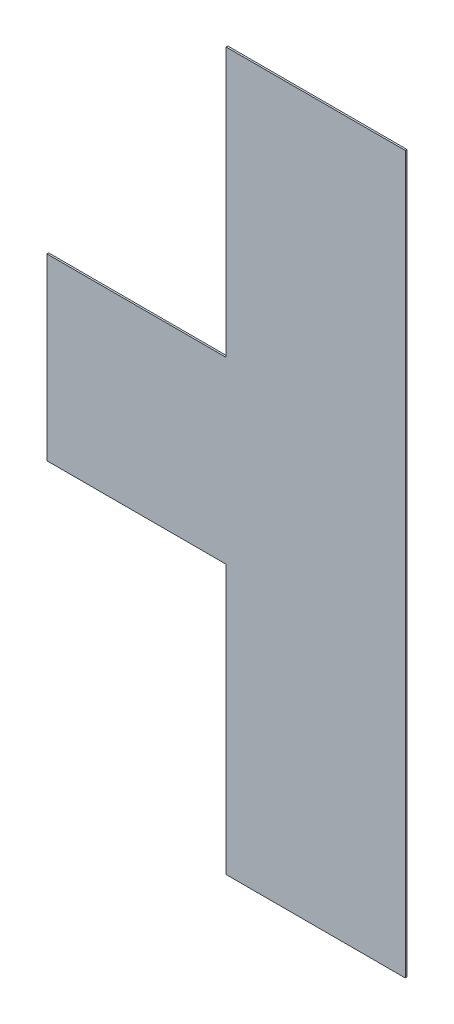
ISO-10303-21;
HEADER;
FILE_DESCRIPTION(('STEP AP214'),'2;1');
FILE_NAME('part.step','',(''),(''),'','','');
FILE_SCHEMA(('AUTOMOTIVE_DESIGN { 1 0 10303 214 1 1 1 1 }'));
ENDSEC;
DATA;
#1=APPLICATION_CONTEXT('core data for automotive mechanical design processes');
#2=APPLICATION_PROTOCOL_DEFINITION('international standard','automotive_design',2000,#1);
#3=PRODUCT_CONTEXT('',#1,'mechanical');
#4=PRODUCT('Part','Part','',(#3));
#5=PRODUCT_RELATED_PRODUCT_CATEGORY('part','',(#4));
#6=PRODUCT_DEFINITION_FORMATION('','',#4);
#7=PRODUCT_DEFINITION_CONTEXT('part definition',#1,'design');
#8=PRODUCT_DEFINITION('design','',#6,#7);
#9=PRODUCT_DEFINITION_SHAPE('','',#8);
#10=(LENGTH_UNIT() NAMED_UNIT(*) SI_UNIT(.MILLI.,.METRE.));
#11=(NAMED_UNIT(*) PLANE_ANGLE_UNIT() SI_UNIT($,.RADIAN.));
#12=(NAMED_UNIT(*) SI_UNIT($,.STERADIAN.) SOLID_ANGLE_UNIT());
#13=UNCERTAINTY_MEASURE_WITH_UNIT(LENGTH_MEASURE(1.E-05),#10,'distance_accuracy_value','');
#14=(GEOMETRIC_REPRESENTATION_CONTEXT(3) GLOBAL_UNCERTAINTY_ASSIGNED_CONTEXT((#13)) GLOBAL_UNIT_ASSIGNED_CONTEXT((#10,
#11,#12)) REPRESENTATION_CONTEXT('',''));
#15=CARTESIAN_POINT('',(0.,0.,0.));
#16=DIRECTION('',(0.,0.,1.));
#17=DIRECTION('',(1.,0.,0.));
#18=AXIS2_PLACEMENT_3D('',#15,#16,#17);
#19=CARTESIAN_POINT('',(0.2,0.4,0.002));
#20=DIRECTION('',(0.,0.,1.));
#21=DIRECTION('',(0.,-1.,0.));
#22=AXIS2_PLACEMENT_3D('',#19,#20,#21);
#23=PLANE('',#22);
#24=DIRECTION('',(-1.,0.,0.));
#25=VECTOR('',#24,1.);
#26=CARTESIAN_POINT('',(0.2,-0.4,0.002));
#27=LINE('',#26,#25);
#28=CARTESIAN_POINT('',(0.2,-0.4,0.002));
#29=VERTEX_POINT('',#28);
#30=CARTESIAN_POINT('',(0.,-0.4,0.002));
#31=VERTEX_POINT('',#30);
#32=EDGE_CURVE('E160',#29,#31,#27,.T.);
#33=ORIENTED_EDGE('',*,*,#32,.F.);
#34=DIRECTION('',(0.,-1.,0.));
#35=VECTOR('',#34,1.);
#36=CARTESIAN_POINT('',(0.2,0.4,0.002));
#37=LINE('',#36,#35);
#38=CARTESIAN_POINT('',(0.2,0.4,0.002));
#39=VERTEX_POINT('',#38);
#40=EDGE_CURVE('E164',#39,#29,#37,.T.);
#41=ORIENTED_EDGE('',*,*,#40,.F.);
#42=DIRECTION('',(-1.,0.,0.));
#43=VECTOR('',#42,1.);
#44=CARTESIAN_POINT('',(0.2,0.4,0.002));
#45=LINE('',#44,#43);
#46=CARTESIAN_POINT('',(0.,0.4,0.002));
#47=VERTEX_POINT('',#46);
#48=EDGE_CURVE('E11',#39,#47,#45,.T.);
#49=ORIENTED_EDGE('',*,*,#48,.T.);
#50=DIRECTION('',(0.,-1.,0.));
#51=VECTOR('',#50,1.);
#52=CARTESIAN_POINT('',(0.,0.4,0.002));
#53=LINE('',#52,#51);
#54=CARTESIAN_POINT('',(0.,0.1,0.002));
#55=VERTEX_POINT('',#54);
#56=EDGE_CURVE('E76',#47,#55,#53,.T.);
#57=ORIENTED_EDGE('',*,*,#56,.T.);
#58=DIRECTION('',(-1.,0.,0.));
#59=VECTOR('',#58,1.);
#60=CARTESIAN_POINT('',(0.,0.1,0.002));
#61=LINE('',#60,#59);
#62=CARTESIAN_POINT('',(-0.2,0.1,0.002));
#63=VERTEX_POINT('',#62);
#64=EDGE_CURVE('E74',#55,#63,#61,.T.);
#65=ORIENTED_EDGE('',*,*,#64,.T.);
#66=DIRECTION('',(0.,1.,0.));
#67=VECTOR('',#66,1.);
#68=CARTESIAN_POINT('',(-0.2,-0.1,0.002));
#69=LINE('',#68,#67);
#70=CARTESIAN_POINT('',(-0.2,-0.1,0.002));
#71=VERTEX_POINT('',#70);
#72=EDGE_CURVE('E68',#71,#63,#69,.T.);
#73=ORIENTED_EDGE('',*,*,#72,.F.);
#74=DIRECTION('',(-1.,0.,0.));
#75=VECTOR('',#74,1.);
#76=CARTESIAN_POINT('',(0.,-0.1,0.002));
#77=LINE('',#76,#75);
#78=CARTESIAN_POINT('',(0.,-0.1,0.002));
#79=VERTEX_POINT('',#78);
#80=EDGE_CURVE('E101',#79,#71,#77,.T.);
#81=ORIENTED_EDGE('',*,*,#80,.F.);
#82=DIRECTION('',(0.,1.,0.));
#83=VECTOR('',#82,1.);
#84=CARTESIAN_POINT('',(0.,-0.4,0.002));
#85=LINE('',#84,#83);
#86=EDGE_CURVE('E186',#31,#79,#85,.T.);
#87=ORIENTED_EDGE('',*,*,#86,.F.);
#88=EDGE_LOOP('',(#33,#41,#49,#57,#65,#73,#81,#87));
#89=FACE_BOUND('',#88,.T.);
#90=ADVANCED_FACE('F17',(#89),#23,.T.);
#91=CARTESIAN_POINT('',(0.2,0.4,0.));
#92=DIRECTION('',(0.,-1.,0.));
#93=DIRECTION('',(-1.,0.,0.));
#94=AXIS2_PLACEMENT_3D('',#91,#92,#93);
#95=PLANE('',#94);
#96=DIRECTION('',(0.,0.,1.));
#97=VECTOR('',#96,1.);
#98=CARTESIAN_POINT('',(0.,0.4,0.));
#99=LINE('',#98,#97);
#100=CARTESIAN_POINT('',(0.,0.4,0.));
#101=VERTEX_POINT('',#100);
#102=EDGE_CURVE('E27',#101,#47,#99,.T.);
#103=ORIENTED_EDGE('',*,*,#102,.T.);
#104=ORIENTED_EDGE('',*,*,#48,.F.);
#105=DIRECTION('',(0.,0.,1.));
#106=VECTOR('',#105,1.);
#107=CARTESIAN_POINT('',(0.2,0.4,0.));
#108=LINE('',#107,#106);
#109=CARTESIAN_POINT('',(0.2,0.4,0.));
#110=VERTEX_POINT('',#109);
#111=EDGE_CURVE('E200',#110,#39,#108,.T.);
#112=ORIENTED_EDGE('',*,*,#111,.F.);
#113=DIRECTION('',(-1.,0.,0.));
#114=VECTOR('',#113,1.);
#115=CARTESIAN_POINT('',(0.2,0.4,0.));
#116=LINE('',#115,#114);
#117=EDGE_CURVE('E120',#110,#101,#116,.T.);
#118=ORIENTED_EDGE('',*,*,#117,.T.);
#119=EDGE_LOOP('',(#103,#104,#112,#118));
#120=FACE_BOUND('',#119,.T.);
#121=ADVANCED_FACE('F118',(#120),#95,.F.);
#122=CARTESIAN_POINT('',(0.,0.4,0.));
#123=DIRECTION('',(1.,0.,0.));
#124=DIRECTION('',(0.,1.,0.));
#125=AXIS2_PLACEMENT_3D('',#122,#123,#124);
#126=PLANE('',#125);
#127=DIRECTION('',(0.,0.,1.));
#128=VECTOR('',#127,1.);
#129=CARTESIAN_POINT('',(0.,0.1,0.));
#130=LINE('',#129,#128);
#131=CARTESIAN_POINT('',(0.,0.1,0.));
#132=VERTEX_POINT('',#131);
#133=EDGE_CURVE('E82',#132,#55,#130,.T.);
#134=ORIENTED_EDGE('',*,*,#133,.T.);
#135=ORIENTED_EDGE('',*,*,#56,.F.);
#136=ORIENTED_EDGE('',*,*,#102,.F.);
#137=DIRECTION('',(0.,-1.,0.));
#138=VECTOR('',#137,1.);
#139=CARTESIAN_POINT('',(0.,0.4,0.));
#140=LINE('',#139,#138);
#141=EDGE_CURVE('E124',#101,#132,#140,.T.);
#142=ORIENTED_EDGE('',*,*,#141,.T.);
#143=EDGE_LOOP('',(#134,#135,#136,#142));
#144=FACE_BOUND('',#143,.T.);
#145=ADVANCED_FACE('F19',(#144),#126,.F.);
#146=CARTESIAN_POINT('',(0.,0.1,0.));
#147=DIRECTION('',(0.,-1.,0.));
#148=DIRECTION('',(-1.,0.,0.));
#149=AXIS2_PLACEMENT_3D('',#146,#147,#148);
#150=PLANE('',#149);
#151=DIRECTION('',(0.,0.,-1.));
#152=VECTOR('',#151,1.);
#153=CARTESIAN_POINT('',(-0.2,0.1,0.));
#154=LINE('',#153,#152);
#155=CARTESIAN_POINT('',(-0.2,0.1,0.));
#156=VERTEX_POINT('',#155);
#157=EDGE_CURVE('E90',#63,#156,#154,.T.);
#158=ORIENTED_EDGE('',*,*,#157,.F.);
#159=ORIENTED_EDGE('',*,*,#64,.F.);
#160=ORIENTED_EDGE('',*,*,#133,.F.);
#161=DIRECTION('',(-1.,0.,0.));
#162=VECTOR('',#161,1.);
#163=CARTESIAN_POINT('',(0.2,0.1,0.));
#164=LINE('',#163,#162);
#165=EDGE_CURVE('E98',#132,#156,#164,.T.);
#166=ORIENTED_EDGE('',*,*,#165,.T.);
#167=EDGE_LOOP('',(#158,#159,#160,#166));
#168=FACE_BOUND('',#167,.T.);
#169=ADVANCED_FACE('F96',(#168),#150,.F.);
#170=CARTESIAN_POINT('',(-0.2,-0.1,0.));
#171=DIRECTION('',(-1.,0.,0.));
#172=DIRECTION('',(0.,0.,1.));
#173=AXIS2_PLACEMENT_3D('',#170,#171,#172);
#174=PLANE('',#173);
#175=ORIENTED_EDGE('',*,*,#157,.T.);
#176=DIRECTION('',(0.,-1.,0.));
#177=VECTOR('',#176,1.);
#178=CARTESIAN_POINT('',(-0.2,0.4,0.));
#179=LINE('',#178,#177);
#180=CARTESIAN_POINT('',(-0.2,-0.1,0.));
#181=VERTEX_POINT('',#180);
#182=EDGE_CURVE('E189',#156,#181,#179,.T.);
#183=ORIENTED_EDGE('',*,*,#182,.T.);
#184=DIRECTION('',(0.,0.,-1.));
#185=VECTOR('',#184,1.);
#186=CARTESIAN_POINT('',(-0.2,-0.1,0.));
#187=LINE('',#186,#185);
#188=EDGE_CURVE('E93',#71,#181,#187,.T.);
#189=ORIENTED_EDGE('',*,*,#188,.F.);
#190=ORIENTED_EDGE('',*,*,#72,.T.);
#191=EDGE_LOOP('',(#175,#183,#189,#190));
#192=FACE_BOUND('',#191,.T.);
#193=ADVANCED_FACE('F87',(#192),#174,.T.);
#194=CARTESIAN_POINT('',(0.,-0.1,0.));
#195=DIRECTION('',(0.,-1.,0.));
#196=DIRECTION('',(-1.,0.,0.));
#197=AXIS2_PLACEMENT_3D('',#194,#195,#196);
#198=PLANE('',#197);
#199=ORIENTED_EDGE('',*,*,#188,.T.);
#200=DIRECTION('',(1.,0.,0.));
#201=VECTOR('',#200,1.);
#202=CARTESIAN_POINT('',(0.2,-0.1,0.));
#203=LINE('',#202,#201);
#204=CARTESIAN_POINT('',(0.,-0.1,0.));
#205=VERTEX_POINT('',#204);
#206=EDGE_CURVE('E175',#181,#205,#203,.T.);
#207=ORIENTED_EDGE('',*,*,#206,.T.);
#208=DIRECTION('',(0.,0.,-1.));
#209=VECTOR('',#208,1.);
#210=CARTESIAN_POINT('',(0.,-0.1,0.));
#211=LINE('',#210,#209);
#212=EDGE_CURVE('E170',#79,#205,#211,.T.);
#213=ORIENTED_EDGE('',*,*,#212,.F.);
#214=ORIENTED_EDGE('',*,*,#80,.T.);
#215=EDGE_LOOP('',(#199,#207,#213,#214));
#216=FACE_BOUND('',#215,.T.);
#217=ADVANCED_FACE('F326',(#216),#198,.T.);
#218=CARTESIAN_POINT('',(0.,-0.4,0.));
#219=DIRECTION('',(-1.,0.,0.));
#220=DIRECTION('',(0.,0.,1.));
#221=AXIS2_PLACEMENT_3D('',#218,#219,#220);
#222=PLANE('',#221);
#223=ORIENTED_EDGE('',*,*,#212,.T.);
#224=DIRECTION('',(0.,-1.,0.));
#225=VECTOR('',#224,1.);
#226=CARTESIAN_POINT('',(0.,0.4,0.));
#227=LINE('',#226,#225);
#228=CARTESIAN_POINT('',(0.,-0.4,0.));
#229=VERTEX_POINT('',#228);
#230=EDGE_CURVE('E167',#205,#229,#227,.T.);
#231=ORIENTED_EDGE('',*,*,#230,.T.);
#232=DIRECTION('',(0.,0.,-1.));
#233=VECTOR('',#232,1.);
#234=CARTESIAN_POINT('',(0.,-0.4,0.));
#235=LINE('',#234,#233);
#236=EDGE_CURVE('E154',#31,#229,#235,.T.);
#237=ORIENTED_EDGE('',*,*,#236,.F.);
#238=ORIENTED_EDGE('',*,*,#86,.T.);
#239=EDGE_LOOP('',(#223,#231,#237,#238));
#240=FACE_BOUND('',#239,.T.);
#241=ADVANCED_FACE('F168',(#240),#222,.T.);
#242=CARTESIAN_POINT('',(0.2,-0.4,0.));
#243=DIRECTION('',(0.,-1.,0.));
#244=DIRECTION('',(-1.,0.,0.));
#245=AXIS2_PLACEMENT_3D('',#242,#243,#244);
#246=PLANE('',#245);
#247=ORIENTED_EDGE('',*,*,#236,.T.);
#248=DIRECTION('',(1.,0.,0.));
#249=VECTOR('',#248,1.);
#250=CARTESIAN_POINT('',(0.2,-0.4,0.));
#251=LINE('',#250,#249);
#252=CARTESIAN_POINT('',(0.2,-0.4,0.));
#253=VERTEX_POINT('',#252);
#254=EDGE_CURVE('E159',#229,#253,#251,.T.);
#255=ORIENTED_EDGE('',*,*,#254,.T.);
#256=DIRECTION('',(0.,0.,-1.));
#257=VECTOR('',#256,1.);
#258=CARTESIAN_POINT('',(0.2,-0.4,0.));
#259=LINE('',#258,#257);
#260=EDGE_CURVE('E204',#29,#253,#259,.T.);
#261=ORIENTED_EDGE('',*,*,#260,.F.);
#262=ORIENTED_EDGE('',*,*,#32,.T.);
#263=EDGE_LOOP('',(#247,#255,#261,#262));
#264=FACE_BOUND('',#263,.T.);
#265=ADVANCED_FACE('F156',(#264),#246,.T.);
#266=CARTESIAN_POINT('',(0.2,0.4,0.));
#267=DIRECTION('',(1.,0.,0.));
#268=DIRECTION('',(0.,1.,0.));
#269=AXIS2_PLACEMENT_3D('',#266,#267,#268);
#270=PLANE('',#269);
#271=ORIENTED_EDGE('',*,*,#260,.T.);
#272=DIRECTION('',(0.,1.,0.));
#273=VECTOR('',#272,1.);
#274=CARTESIAN_POINT('',(0.2,0.4,0.));
#275=LINE('',#274,#273);
#276=EDGE_CURVE('E180',#253,#110,#275,.T.);
#277=ORIENTED_EDGE('',*,*,#276,.T.);
#278=ORIENTED_EDGE('',*,*,#111,.T.);
#279=ORIENTED_EDGE('',*,*,#40,.T.);
#280=EDGE_LOOP('',(#271,#277,#278,#279));
#281=FACE_BOUND('',#280,.T.);
#282=ADVANCED_FACE('F297',(#281),#270,.T.);
#283=CARTESIAN_POINT('',(0.2,0.4,0.));
#284=DIRECTION('',(0.,0.,1.));
#285=DIRECTION('',(0.,-1.,0.));
#286=AXIS2_PLACEMENT_3D('',#283,#284,#285);
#287=PLANE('',#286);
#288=ORIENTED_EDGE('',*,*,#254,.F.);
#289=ORIENTED_EDGE('',*,*,#230,.F.);
#290=ORIENTED_EDGE('',*,*,#206,.F.);
#291=ORIENTED_EDGE('',*,*,#182,.F.);
#292=ORIENTED_EDGE('',*,*,#165,.F.);
#293=ORIENTED_EDGE('',*,*,#141,.F.);
#294=ORIENTED_EDGE('',*,*,#117,.F.);
#295=ORIENTED_EDGE('',*,*,#276,.F.);
#296=EDGE_LOOP('',(#288,#289,#290,#291,#292,#293,#294,#295));
#297=FACE_BOUND('',#296,.T.);
#298=ADVANCED_FACE('F178',(#297),#287,.F.);
#299=CLOSED_SHELL('',(#90,#121,#145,#169,#193,#217,#241,#265,#282,#298));
#300=MANIFOLD_SOLID_BREP('B1',#299);
#301=ADVANCED_BREP_SHAPE_REPRESENTATION('',(#18,#300),#14);
#302=SHAPE_DEFINITION_REPRESENTATION(#9,#301);
ENDSEC;
END-ISO-10303-21;
